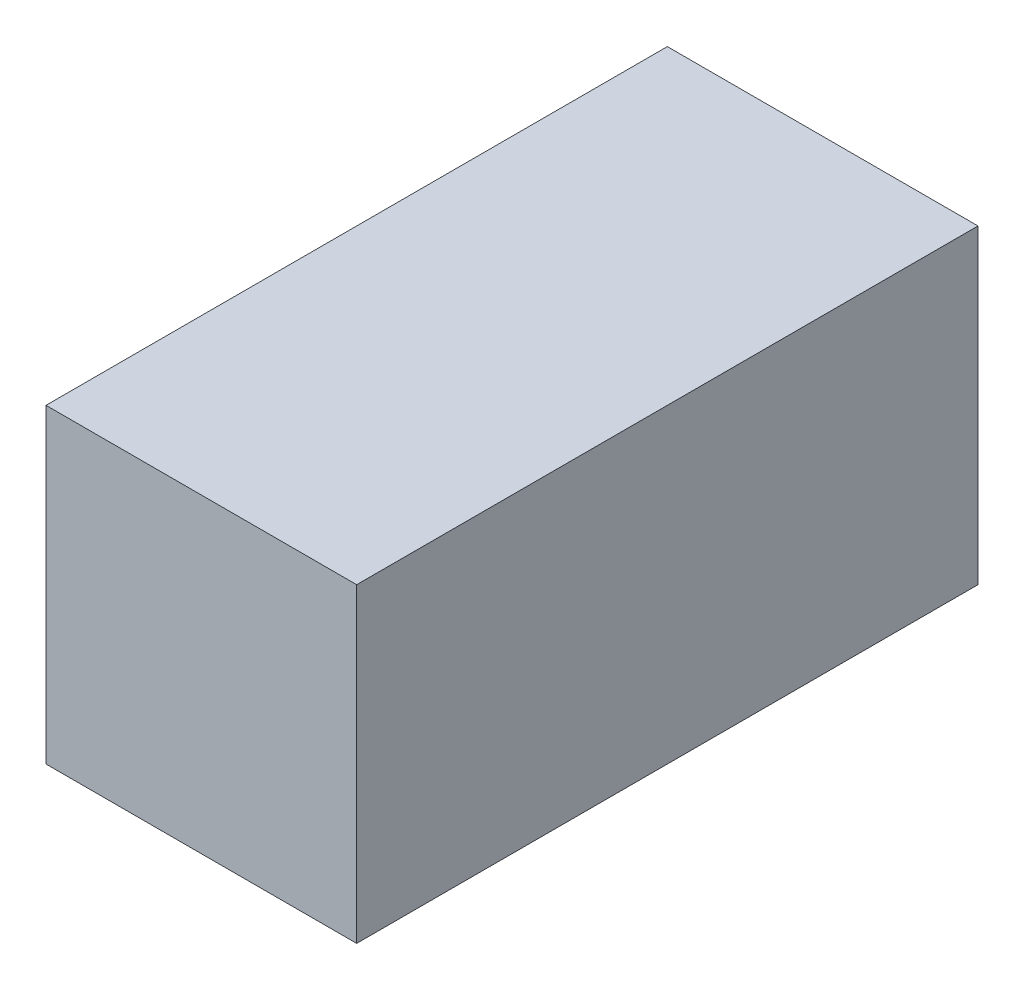
ISO-10303-21;
HEADER;
FILE_DESCRIPTION(('STEP AP214'),'2;1');
FILE_NAME('part.step','',(''),(''),'','','');
FILE_SCHEMA(('AUTOMOTIVE_DESIGN { 1 0 10303 214 1 1 1 1 }'));
ENDSEC;
DATA;
#1=APPLICATION_CONTEXT('core data for automotive mechanical design processes');
#2=APPLICATION_PROTOCOL_DEFINITION('international standard','automotive_design',2000,#1);
#3=PRODUCT_CONTEXT('',#1,'mechanical');
#4=PRODUCT('Part','Part','',(#3));
#5=PRODUCT_RELATED_PRODUCT_CATEGORY('part','',(#4));
#6=PRODUCT_DEFINITION_FORMATION('','',#4);
#7=PRODUCT_DEFINITION_CONTEXT('part definition',#1,'design');
#8=PRODUCT_DEFINITION('design','',#6,#7);
#9=PRODUCT_DEFINITION_SHAPE('','',#8);
#10=(LENGTH_UNIT() NAMED_UNIT(*) SI_UNIT(.MILLI.,.METRE.));
#11=(NAMED_UNIT(*) PLANE_ANGLE_UNIT() SI_UNIT($,.RADIAN.));
#12=(NAMED_UNIT(*) SI_UNIT($,.STERADIAN.) SOLID_ANGLE_UNIT());
#13=UNCERTAINTY_MEASURE_WITH_UNIT(LENGTH_MEASURE(1.E-05),#10,'distance_accuracy_value','');
#14=(GEOMETRIC_REPRESENTATION_CONTEXT(3) GLOBAL_UNCERTAINTY_ASSIGNED_CONTEXT((#13)) GLOBAL_UNIT_ASSIGNED_CONTEXT((#10,
#11,#12)) REPRESENTATION_CONTEXT('',''));
#15=CARTESIAN_POINT('',(0.,0.,0.));
#16=DIRECTION('',(0.,0.,1.));
#17=DIRECTION('',(1.,0.,0.));
#18=AXIS2_PLACEMENT_3D('',#15,#16,#17);
#19=CARTESIAN_POINT('',(63.5,-63.5,127.));
#20=DIRECTION('',(-1.,0.,0.));
#21=DIRECTION('',(0.,0.,1.));
#22=AXIS2_PLACEMENT_3D('',#19,#20,#21);
#23=PLANE('',#22);
#24=DIRECTION('',(0.,1.,0.));
#25=VECTOR('',#24,1.);
#26=CARTESIAN_POINT('',(63.5,-63.5,-127.));
#27=LINE('',#26,#25);
#28=CARTESIAN_POINT('',(63.5,-63.5,-127.));
#29=VERTEX_POINT('',#28);
#30=CARTESIAN_POINT('',(63.5,63.5,-127.));
#31=VERTEX_POINT('',#30);
#32=EDGE_CURVE('E100',#29,#31,#27,.T.);
#33=ORIENTED_EDGE('',*,*,#32,.T.);
#34=DIRECTION('',(0.,0.,-1.));
#35=VECTOR('',#34,1.);
#36=CARTESIAN_POINT('',(63.5,63.5,127.));
#37=LINE('',#36,#35);
#38=CARTESIAN_POINT('',(63.5,63.5,127.));
#39=VERTEX_POINT('',#38);
#40=EDGE_CURVE('E11',#39,#31,#37,.T.);
#41=ORIENTED_EDGE('',*,*,#40,.F.);
#42=DIRECTION('',(0.,1.,0.));
#43=VECTOR('',#42,1.);
#44=CARTESIAN_POINT('',(63.5,-63.5,127.));
#45=LINE('',#44,#43);
#46=CARTESIAN_POINT('',(63.5,-63.5,127.));
#47=VERTEX_POINT('',#46);
#48=EDGE_CURVE('E88',#47,#39,#45,.T.);
#49=ORIENTED_EDGE('',*,*,#48,.F.);
#50=DIRECTION('',(0.,0.,-1.));
#51=VECTOR('',#50,1.);
#52=CARTESIAN_POINT('',(63.5,-63.5,127.));
#53=LINE('',#52,#51);
#54=EDGE_CURVE('E96',#47,#29,#53,.T.);
#55=ORIENTED_EDGE('',*,*,#54,.T.);
#56=EDGE_LOOP('',(#33,#41,#49,#55));
#57=FACE_BOUND('',#56,.T.);
#58=ADVANCED_FACE('F37',(#57),#23,.F.);
#59=CARTESIAN_POINT('',(-63.5,63.5,127.));
#60=DIRECTION('',(0.,-1.,0.));
#61=DIRECTION('',(0.,0.,-1.));
#62=AXIS2_PLACEMENT_3D('',#59,#60,#61);
#63=PLANE('',#62);
#64=DIRECTION('',(-1.,0.,0.));
#65=VECTOR('',#64,1.);
#66=CARTESIAN_POINT('',(-63.5,63.5,-127.));
#67=LINE('',#66,#65);
#68=CARTESIAN_POINT('',(-63.5,63.5,-127.));
#69=VERTEX_POINT('',#68);
#70=EDGE_CURVE('E92',#31,#69,#67,.T.);
#71=ORIENTED_EDGE('',*,*,#70,.T.);
#72=DIRECTION('',(0.,0.,-1.));
#73=VECTOR('',#72,1.);
#74=CARTESIAN_POINT('',(-63.5,63.5,127.));
#75=LINE('',#74,#73);
#76=CARTESIAN_POINT('',(-63.5,63.5,127.));
#77=VERTEX_POINT('',#76);
#78=EDGE_CURVE('E45',#77,#69,#75,.T.);
#79=ORIENTED_EDGE('',*,*,#78,.F.);
#80=DIRECTION('',(-1.,0.,0.));
#81=VECTOR('',#80,1.);
#82=CARTESIAN_POINT('',(-63.5,63.5,127.));
#83=LINE('',#82,#81);
#84=EDGE_CURVE('E83',#39,#77,#83,.T.);
#85=ORIENTED_EDGE('',*,*,#84,.F.);
#86=ORIENTED_EDGE('',*,*,#40,.T.);
#87=EDGE_LOOP('',(#71,#79,#85,#86));
#88=FACE_BOUND('',#87,.T.);
#89=ADVANCED_FACE('F91',(#88),#63,.F.);
#90=CARTESIAN_POINT('',(-63.5,-63.5,127.));
#91=DIRECTION('',(1.,0.,0.));
#92=DIRECTION('',(0.,0.,-1.));
#93=AXIS2_PLACEMENT_3D('',#90,#91,#92);
#94=PLANE('',#93);
#95=DIRECTION('',(0.,-1.,0.));
#96=VECTOR('',#95,1.);
#97=CARTESIAN_POINT('',(-63.5,-63.5,-127.));
#98=LINE('',#97,#96);
#99=CARTESIAN_POINT('',(-63.5,-63.5,-127.));
#100=VERTEX_POINT('',#99);
#101=EDGE_CURVE('E70',#69,#100,#98,.T.);
#102=ORIENTED_EDGE('',*,*,#101,.T.);
#103=DIRECTION('',(0.,0.,-1.));
#104=VECTOR('',#103,1.);
#105=CARTESIAN_POINT('',(-63.5,-63.5,127.));
#106=LINE('',#105,#104);
#107=CARTESIAN_POINT('',(-63.5,-63.5,127.));
#108=VERTEX_POINT('',#107);
#109=EDGE_CURVE('E93',#108,#100,#106,.T.);
#110=ORIENTED_EDGE('',*,*,#109,.F.);
#111=DIRECTION('',(0.,-1.,0.));
#112=VECTOR('',#111,1.);
#113=CARTESIAN_POINT('',(-63.5,-63.5,127.));
#114=LINE('',#113,#112);
#115=EDGE_CURVE('E86',#77,#108,#114,.T.);
#116=ORIENTED_EDGE('',*,*,#115,.F.);
#117=ORIENTED_EDGE('',*,*,#78,.T.);
#118=EDGE_LOOP('',(#102,#110,#116,#117));
#119=FACE_BOUND('',#118,.T.);
#120=ADVANCED_FACE('F94',(#119),#94,.F.);
#121=CARTESIAN_POINT('',(-63.5,-63.5,127.));
#122=DIRECTION('',(0.,1.,0.));
#123=DIRECTION('',(0.,0.,1.));
#124=AXIS2_PLACEMENT_3D('',#121,#122,#123);
#125=PLANE('',#124);
#126=DIRECTION('',(1.,0.,0.));
#127=VECTOR('',#126,1.);
#128=CARTESIAN_POINT('',(-63.5,-63.5,-127.));
#129=LINE('',#128,#127);
#130=EDGE_CURVE('E76',#100,#29,#129,.T.);
#131=ORIENTED_EDGE('',*,*,#130,.T.);
#132=ORIENTED_EDGE('',*,*,#54,.F.);
#133=DIRECTION('',(1.,0.,0.));
#134=VECTOR('',#133,1.);
#135=CARTESIAN_POINT('',(-63.5,-63.5,127.));
#136=LINE('',#135,#134);
#137=EDGE_CURVE('E53',#108,#47,#136,.T.);
#138=ORIENTED_EDGE('',*,*,#137,.F.);
#139=ORIENTED_EDGE('',*,*,#109,.T.);
#140=EDGE_LOOP('',(#131,#132,#138,#139));
#141=FACE_BOUND('',#140,.T.);
#142=ADVANCED_FACE('F107',(#141),#125,.F.);
#143=CARTESIAN_POINT('',(0.,0.,127.));
#144=DIRECTION('',(0.,0.,-1.));
#145=DIRECTION('',(-1.,0.,0.));
#146=AXIS2_PLACEMENT_3D('',#143,#144,#145);
#147=PLANE('',#146);
#148=ORIENTED_EDGE('',*,*,#48,.T.);
#149=ORIENTED_EDGE('',*,*,#84,.T.);
#150=ORIENTED_EDGE('',*,*,#115,.T.);
#151=ORIENTED_EDGE('',*,*,#137,.T.);
#152=EDGE_LOOP('',(#148,#149,#150,#151));
#153=FACE_BOUND('',#152,.T.);
#154=ADVANCED_FACE('F84',(#153),#147,.F.);
#155=CARTESIAN_POINT('',(0.,0.,-127.));
#156=DIRECTION('',(0.,0.,-1.));
#157=DIRECTION('',(-1.,0.,0.));
#158=AXIS2_PLACEMENT_3D('',#155,#156,#157);
#159=PLANE('',#158);
#160=ORIENTED_EDGE('',*,*,#32,.F.);
#161=ORIENTED_EDGE('',*,*,#130,.F.);
#162=ORIENTED_EDGE('',*,*,#101,.F.);
#163=ORIENTED_EDGE('',*,*,#70,.F.);
#164=EDGE_LOOP('',(#160,#161,#162,#163));
#165=FACE_BOUND('',#164,.T.);
#166=ADVANCED_FACE('F110',(#165),#159,.T.);
#167=CLOSED_SHELL('',(#58,#89,#120,#142,#154,#166));
#168=MANIFOLD_SOLID_BREP('B2',#167);
#169=ADVANCED_BREP_SHAPE_REPRESENTATION('',(#18,#168),#14);
#170=SHAPE_DEFINITION_REPRESENTATION(#9,#169);
ENDSEC;
END-ISO-10303-21;
